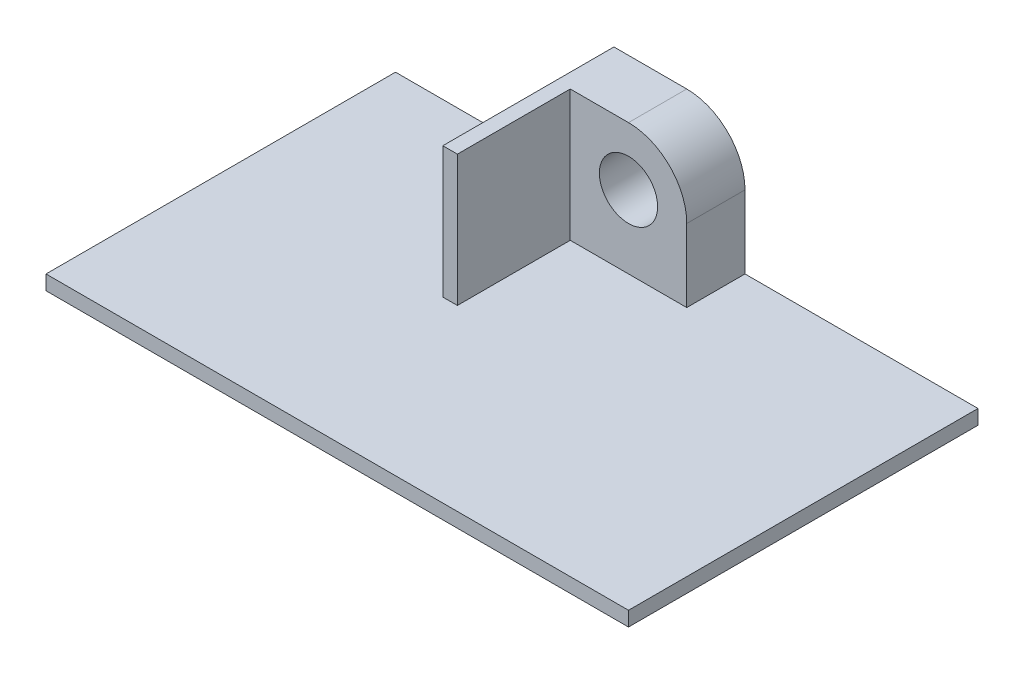
ISO-10303-21;
HEADER;
FILE_DESCRIPTION(('STEP AP214'),'2;1');
FILE_NAME('part.step','',(''),(''),'','','');
FILE_SCHEMA(('AUTOMOTIVE_DESIGN { 1 0 10303 214 1 1 1 1 }'));
ENDSEC;
DATA;
#1=APPLICATION_CONTEXT('core data for automotive mechanical design processes');
#2=APPLICATION_PROTOCOL_DEFINITION('international standard','automotive_design',2000,#1);
#3=PRODUCT_CONTEXT('',#1,'mechanical');
#4=PRODUCT('Part','Part','',(#3));
#5=PRODUCT_RELATED_PRODUCT_CATEGORY('part','',(#4));
#6=PRODUCT_DEFINITION_FORMATION('','',#4);
#7=PRODUCT_DEFINITION_CONTEXT('part definition',#1,'design');
#8=PRODUCT_DEFINITION('design','',#6,#7);
#9=PRODUCT_DEFINITION_SHAPE('','',#8);
#10=(LENGTH_UNIT() NAMED_UNIT(*) SI_UNIT(.MILLI.,.METRE.));
#11=(NAMED_UNIT(*) PLANE_ANGLE_UNIT() SI_UNIT($,.RADIAN.));
#12=(NAMED_UNIT(*) SI_UNIT($,.STERADIAN.) SOLID_ANGLE_UNIT());
#13=UNCERTAINTY_MEASURE_WITH_UNIT(LENGTH_MEASURE(1.E-05),#10,'distance_accuracy_value','');
#14=(GEOMETRIC_REPRESENTATION_CONTEXT(3) GLOBAL_UNCERTAINTY_ASSIGNED_CONTEXT((#13)) GLOBAL_UNIT_ASSIGNED_CONTEXT((#10,
#11,#12)) REPRESENTATION_CONTEXT('',''));
#15=CARTESIAN_POINT('',(0.,0.,0.));
#16=DIRECTION('',(0.,0.,1.));
#17=DIRECTION('',(1.,0.,0.));
#18=AXIS2_PLACEMENT_3D('',#15,#16,#17);
#19=CARTESIAN_POINT('',(0.,1.5875,38.1));
#20=DIRECTION('',(0.,-1.,0.));
#21=DIRECTION('',(0.,0.,-1.));
#22=AXIS2_PLACEMENT_3D('',#19,#20,#21);
#23=PLANE('',#22);
#24=DIRECTION('',(0.,0.,-1.));
#25=VECTOR('',#24,1.);
#26=CARTESIAN_POINT('',(25.4,1.5875,0.));
#27=LINE('',#26,#25);
#28=CARTESIAN_POINT('',(25.4,1.5875,18.653125));
#29=VERTEX_POINT('',#28);
#30=CARTESIAN_POINT('',(25.4,1.5875,6.35));
#31=VERTEX_POINT('',#30);
#32=EDGE_CURVE('E55',#29,#31,#27,.T.);
#33=ORIENTED_EDGE('',*,*,#32,.F.);
#34=DIRECTION('',(1.,0.,0.));
#35=VECTOR('',#34,1.);
#36=CARTESIAN_POINT('',(25.4,1.5875,18.653125));
#37=LINE('',#36,#35);
#38=CARTESIAN_POINT('',(23.8125,1.5875,18.653125));
#39=VERTEX_POINT('',#38);
#40=EDGE_CURVE('E60',#39,#29,#37,.T.);
#41=ORIENTED_EDGE('',*,*,#40,.F.);
#42=DIRECTION('',(0.,0.,1.));
#43=VECTOR('',#42,1.);
#44=CARTESIAN_POINT('',(23.8125,1.5875,0.));
#45=LINE('',#44,#43);
#46=CARTESIAN_POINT('',(23.8125,1.5875,0.));
#47=VERTEX_POINT('',#46);
#48=EDGE_CURVE('E130',#47,#39,#45,.T.);
#49=ORIENTED_EDGE('',*,*,#48,.F.);
#50=DIRECTION('',(-1.,0.,0.));
#51=VECTOR('',#50,1.);
#52=CARTESIAN_POINT('',(0.,1.5875,0.));
#53=LINE('',#52,#51);
#54=CARTESIAN_POINT('',(0.,1.5875,0.));
#55=VERTEX_POINT('',#54);
#56=EDGE_CURVE('E230',#47,#55,#53,.T.);
#57=ORIENTED_EDGE('',*,*,#56,.T.);
#58=DIRECTION('',(0.,0.,-1.));
#59=VECTOR('',#58,1.);
#60=CARTESIAN_POINT('',(0.,1.5875,38.1));
#61=LINE('',#60,#59);
#62=CARTESIAN_POINT('',(0.,1.5875,38.1));
#63=VERTEX_POINT('',#62);
#64=EDGE_CURVE('E220',#63,#55,#61,.T.);
#65=ORIENTED_EDGE('',*,*,#64,.F.);
#66=DIRECTION('',(-1.,0.,0.));
#67=VECTOR('',#66,1.);
#68=CARTESIAN_POINT('',(0.,1.5875,38.1));
#69=LINE('',#68,#67);
#70=CARTESIAN_POINT('',(63.5,1.5875,38.1));
#71=VERTEX_POINT('',#70);
#72=EDGE_CURVE('E217',#71,#63,#69,.T.);
#73=ORIENTED_EDGE('',*,*,#72,.F.);
#74=DIRECTION('',(0.,0.,-1.));
#75=VECTOR('',#74,1.);
#76=CARTESIAN_POINT('',(63.5,1.5875,38.1));
#77=LINE('',#76,#75);
#78=CARTESIAN_POINT('',(63.5,1.5875,0.));
#79=VERTEX_POINT('',#78);
#80=EDGE_CURVE('E237',#71,#79,#77,.T.);
#81=ORIENTED_EDGE('',*,*,#80,.T.);
#82=CARTESIAN_POINT('',(38.1,1.5875,0.));
#83=VERTEX_POINT('',#82);
#84=EDGE_CURVE('E211',#79,#83,#53,.T.);
#85=ORIENTED_EDGE('',*,*,#84,.T.);
#86=DIRECTION('',(0.,0.,-1.));
#87=VECTOR('',#86,1.);
#88=CARTESIAN_POINT('',(38.1,1.5875,6.35));
#89=LINE('',#88,#87);
#90=CARTESIAN_POINT('',(38.1,1.5875,6.35));
#91=VERTEX_POINT('',#90);
#92=EDGE_CURVE('E201',#91,#83,#89,.T.);
#93=ORIENTED_EDGE('',*,*,#92,.F.);
#94=DIRECTION('',(-1.,0.,0.));
#95=VECTOR('',#94,1.);
#96=CARTESIAN_POINT('',(38.1,1.5875,6.35));
#97=LINE('',#96,#95);
#98=EDGE_CURVE('E176',#91,#31,#97,.T.);
#99=ORIENTED_EDGE('',*,*,#98,.T.);
#100=EDGE_LOOP('',(#33,#41,#49,#57,#65,#73,#81,#85,#93,#99));
#101=FACE_BOUND('',#100,.T.);
#102=ADVANCED_FACE('F39',(#101),#23,.F.);
#103=CARTESIAN_POINT('',(0.,0.,38.1));
#104=DIRECTION('',(1.,0.,0.));
#105=DIRECTION('',(0.,0.,-1.));
#106=AXIS2_PLACEMENT_3D('',#103,#104,#105);
#107=PLANE('',#106);
#108=DIRECTION('',(0.,-1.,0.));
#109=VECTOR('',#108,1.);
#110=CARTESIAN_POINT('',(0.,0.,0.));
#111=LINE('',#110,#109);
#112=CARTESIAN_POINT('',(0.,0.,0.));
#113=VERTEX_POINT('',#112);
#114=EDGE_CURVE('E200',#55,#113,#111,.T.);
#115=ORIENTED_EDGE('',*,*,#114,.T.);
#116=DIRECTION('',(0.,0.,-1.));
#117=VECTOR('',#116,1.);
#118=CARTESIAN_POINT('',(0.,0.,38.1));
#119=LINE('',#118,#117);
#120=CARTESIAN_POINT('',(0.,0.,38.1));
#121=VERTEX_POINT('',#120);
#122=EDGE_CURVE('E11',#121,#113,#119,.T.);
#123=ORIENTED_EDGE('',*,*,#122,.F.);
#124=DIRECTION('',(0.,-1.,0.));
#125=VECTOR('',#124,1.);
#126=CARTESIAN_POINT('',(0.,0.,38.1));
#127=LINE('',#126,#125);
#128=EDGE_CURVE('E206',#63,#121,#127,.T.);
#129=ORIENTED_EDGE('',*,*,#128,.F.);
#130=ORIENTED_EDGE('',*,*,#64,.T.);
#131=EDGE_LOOP('',(#115,#123,#129,#130));
#132=FACE_BOUND('',#131,.T.);
#133=ADVANCED_FACE('F41',(#132),#107,.F.);
#134=CARTESIAN_POINT('',(0.,0.,38.1));
#135=DIRECTION('',(0.,1.,0.));
#136=DIRECTION('',(0.,0.,1.));
#137=AXIS2_PLACEMENT_3D('',#134,#135,#136);
#138=PLANE('',#137);
#139=DIRECTION('',(1.,0.,0.));
#140=VECTOR('',#139,1.);
#141=CARTESIAN_POINT('',(0.,0.,0.));
#142=LINE('',#141,#140);
#143=CARTESIAN_POINT('',(63.5,0.,0.));
#144=VERTEX_POINT('',#143);
#145=EDGE_CURVE('E224',#113,#144,#142,.T.);
#146=ORIENTED_EDGE('',*,*,#145,.T.);
#147=DIRECTION('',(0.,0.,-1.));
#148=VECTOR('',#147,1.);
#149=CARTESIAN_POINT('',(63.5,0.,38.1));
#150=LINE('',#149,#148);
#151=CARTESIAN_POINT('',(63.5,0.,38.1));
#152=VERTEX_POINT('',#151);
#153=EDGE_CURVE('E48',#152,#144,#150,.T.);
#154=ORIENTED_EDGE('',*,*,#153,.F.);
#155=DIRECTION('',(1.,0.,0.));
#156=VECTOR('',#155,1.);
#157=CARTESIAN_POINT('',(0.,0.,38.1));
#158=LINE('',#157,#156);
#159=EDGE_CURVE('E210',#121,#152,#158,.T.);
#160=ORIENTED_EDGE('',*,*,#159,.F.);
#161=ORIENTED_EDGE('',*,*,#122,.T.);
#162=EDGE_LOOP('',(#146,#154,#160,#161));
#163=FACE_BOUND('',#162,.T.);
#164=ADVANCED_FACE('F263',(#163),#138,.F.);
#165=CARTESIAN_POINT('',(63.5,0.,38.1));
#166=DIRECTION('',(-1.,0.,0.));
#167=DIRECTION('',(0.,0.,1.));
#168=AXIS2_PLACEMENT_3D('',#165,#166,#167);
#169=PLANE('',#168);
#170=DIRECTION('',(0.,1.,0.));
#171=VECTOR('',#170,1.);
#172=CARTESIAN_POINT('',(63.5,0.,0.));
#173=LINE('',#172,#171);
#174=EDGE_CURVE('E227',#144,#79,#173,.T.);
#175=ORIENTED_EDGE('',*,*,#174,.T.);
#176=ORIENTED_EDGE('',*,*,#80,.F.);
#177=DIRECTION('',(0.,1.,0.));
#178=VECTOR('',#177,1.);
#179=CARTESIAN_POINT('',(63.5,0.,38.1));
#180=LINE('',#179,#178);
#181=EDGE_CURVE('E214',#152,#71,#180,.T.);
#182=ORIENTED_EDGE('',*,*,#181,.F.);
#183=ORIENTED_EDGE('',*,*,#153,.T.);
#184=EDGE_LOOP('',(#175,#176,#182,#183));
#185=FACE_BOUND('',#184,.T.);
#186=ADVANCED_FACE('F246',(#185),#169,.F.);
#187=CARTESIAN_POINT('',(0.,0.,38.1));
#188=DIRECTION('',(0.,0.,-1.));
#189=DIRECTION('',(-1.,0.,0.));
#190=AXIS2_PLACEMENT_3D('',#187,#188,#189);
#191=PLANE('',#190);
#192=ORIENTED_EDGE('',*,*,#128,.T.);
#193=ORIENTED_EDGE('',*,*,#159,.T.);
#194=ORIENTED_EDGE('',*,*,#181,.T.);
#195=ORIENTED_EDGE('',*,*,#72,.T.);
#196=EDGE_LOOP('',(#192,#193,#194,#195));
#197=FACE_BOUND('',#196,.T.);
#198=ADVANCED_FACE('F261',(#197),#191,.F.);
#199=CARTESIAN_POINT('',(0.,0.,0.));
#200=DIRECTION('',(0.,0.,-1.));
#201=DIRECTION('',(-1.,0.,0.));
#202=AXIS2_PLACEMENT_3D('',#199,#200,#201);
#203=PLANE('',#202);
#204=ORIENTED_EDGE('',*,*,#56,.F.);
#205=DIRECTION('',(0.,-1.,0.));
#206=VECTOR('',#205,1.);
#207=CARTESIAN_POINT('',(23.8125,34.5955563089248,0.));
#208=LINE('',#207,#206);
#209=CARTESIAN_POINT('',(23.8125,15.875,0.));
#210=VERTEX_POINT('',#209);
#211=EDGE_CURVE('E159',#210,#47,#208,.T.);
#212=ORIENTED_EDGE('',*,*,#211,.F.);
#213=DIRECTION('',(1.,0.,0.));
#214=VECTOR('',#213,1.);
#215=CARTESIAN_POINT('',(31.75,15.875,0.));
#216=LINE('',#215,#214);
#217=CARTESIAN_POINT('',(31.75,15.875,0.));
#218=VERTEX_POINT('',#217);
#219=EDGE_CURVE('E146',#210,#218,#216,.T.);
#220=ORIENTED_EDGE('',*,*,#219,.T.);
#221=CARTESIAN_POINT('',(31.75,9.525,0.));
#222=DIRECTION('',(0.,0.,-1.));
#223=DIRECTION('',(-1.,0.,0.));
#224=AXIS2_PLACEMENT_3D('',#221,#222,#223);
#225=CIRCLE('',#224,6.35);
#226=CARTESIAN_POINT('',(38.1,9.525,0.));
#227=VERTEX_POINT('',#226);
#228=EDGE_CURVE('E166',#218,#227,#225,.T.);
#229=ORIENTED_EDGE('',*,*,#228,.T.);
#230=DIRECTION('',(0.,-1.,0.));
#231=VECTOR('',#230,1.);
#232=CARTESIAN_POINT('',(38.1,9.525,0.));
#233=LINE('',#232,#231);
#234=EDGE_CURVE('E191',#227,#83,#233,.T.);
#235=ORIENTED_EDGE('',*,*,#234,.T.);
#236=ORIENTED_EDGE('',*,*,#84,.F.);
#237=ORIENTED_EDGE('',*,*,#174,.F.);
#238=ORIENTED_EDGE('',*,*,#145,.F.);
#239=ORIENTED_EDGE('',*,*,#114,.F.);
#240=EDGE_LOOP('',(#204,#212,#220,#229,#235,#236,#237,#238,#239));
#241=FACE_BOUND('',#240,.T.);
#242=CARTESIAN_POINT('',(31.75,9.525,0.));
#243=DIRECTION('',(0.,0.,-1.));
#244=DIRECTION('',(-1.,0.,0.));
#245=AXIS2_PLACEMENT_3D('',#242,#243,#244);
#246=CIRCLE('',#245,3.175);
#247=CARTESIAN_POINT('',(28.575,9.525,0.));
#248=VERTEX_POINT('',#247);
#249=EDGE_CURVE('E148',#248,#248,#246,.T.);
#250=ORIENTED_EDGE('',*,*,#249,.F.);
#251=EDGE_LOOP('',(#250));
#252=FACE_BOUND('',#251,.T.);
#253=ADVANCED_FACE('F252',(#241,#252),#203,.T.);
#254=CARTESIAN_POINT('',(31.75,9.525,6.35));
#255=DIRECTION('',(0.,0.,-1.));
#256=DIRECTION('',(-1.,0.,0.));
#257=AXIS2_PLACEMENT_3D('',#254,#255,#256);
#258=CYLINDRICAL_SURFACE('',#257,6.35);
#259=ORIENTED_EDGE('',*,*,#228,.F.);
#260=DIRECTION('',(0.,0.,-1.));
#261=VECTOR('',#260,1.);
#262=CARTESIAN_POINT('',(31.75,15.875,6.35));
#263=LINE('',#262,#261);
#264=CARTESIAN_POINT('',(31.75,15.875,6.35));
#265=VERTEX_POINT('',#264);
#266=EDGE_CURVE('E197',#265,#218,#263,.T.);
#267=ORIENTED_EDGE('',*,*,#266,.F.);
#268=CARTESIAN_POINT('',(31.75,9.525,6.35));
#269=DIRECTION('',(0.,0.,-1.));
#270=DIRECTION('',(-1.,0.,0.));
#271=AXIS2_PLACEMENT_3D('',#268,#269,#270);
#272=CIRCLE('',#271,6.35);
#273=CARTESIAN_POINT('',(38.1,9.525,6.35));
#274=VERTEX_POINT('',#273);
#275=EDGE_CURVE('E168',#265,#274,#272,.T.);
#276=ORIENTED_EDGE('',*,*,#275,.T.);
#277=DIRECTION('',(0.,0.,-1.));
#278=VECTOR('',#277,1.);
#279=CARTESIAN_POINT('',(38.1,9.525,6.35));
#280=LINE('',#279,#278);
#281=EDGE_CURVE('E187',#274,#227,#280,.T.);
#282=ORIENTED_EDGE('',*,*,#281,.T.);
#283=EDGE_LOOP('',(#259,#267,#276,#282));
#284=FACE_BOUND('',#283,.T.);
#285=ADVANCED_FACE('F278',(#284),#258,.T.);
#286=CARTESIAN_POINT('',(31.75,15.875,6.35));
#287=DIRECTION('',(0.,1.,0.));
#288=DIRECTION('',(0.,0.,1.));
#289=AXIS2_PLACEMENT_3D('',#286,#287,#288);
#290=PLANE('',#289);
#291=ORIENTED_EDGE('',*,*,#219,.F.);
#292=DIRECTION('',(0.,0.,1.));
#293=VECTOR('',#292,1.);
#294=CARTESIAN_POINT('',(23.8125,15.875,0.));
#295=LINE('',#294,#293);
#296=CARTESIAN_POINT('',(23.8125,15.875,18.653125));
#297=VERTEX_POINT('',#296);
#298=EDGE_CURVE('E128',#210,#297,#295,.T.);
#299=ORIENTED_EDGE('',*,*,#298,.T.);
#300=DIRECTION('',(1.,0.,0.));
#301=VECTOR('',#300,1.);
#302=CARTESIAN_POINT('',(25.4,15.875,18.653125));
#303=LINE('',#302,#301);
#304=CARTESIAN_POINT('',(25.4,15.875,18.653125));
#305=VERTEX_POINT('',#304);
#306=EDGE_CURVE('E135',#297,#305,#303,.T.);
#307=ORIENTED_EDGE('',*,*,#306,.T.);
#308=DIRECTION('',(0.,0.,-1.));
#309=VECTOR('',#308,1.);
#310=CARTESIAN_POINT('',(25.4,15.875,0.));
#311=LINE('',#310,#309);
#312=CARTESIAN_POINT('',(25.4,15.875,6.35));
#313=VERTEX_POINT('',#312);
#314=EDGE_CURVE('E142',#305,#313,#311,.T.);
#315=ORIENTED_EDGE('',*,*,#314,.T.);
#316=DIRECTION('',(1.,0.,0.));
#317=VECTOR('',#316,1.);
#318=CARTESIAN_POINT('',(31.75,15.875,6.35));
#319=LINE('',#318,#317);
#320=EDGE_CURVE('E183',#313,#265,#319,.T.);
#321=ORIENTED_EDGE('',*,*,#320,.T.);
#322=ORIENTED_EDGE('',*,*,#266,.T.);
#323=EDGE_LOOP('',(#291,#299,#307,#315,#321,#322));
#324=FACE_BOUND('',#323,.T.);
#325=ADVANCED_FACE('F144',(#324),#290,.T.);
#326=CARTESIAN_POINT('',(38.1,9.525,6.35));
#327=DIRECTION('',(1.,0.,0.));
#328=DIRECTION('',(0.,0.,-1.));
#329=AXIS2_PLACEMENT_3D('',#326,#327,#328);
#330=PLANE('',#329);
#331=ORIENTED_EDGE('',*,*,#234,.F.);
#332=ORIENTED_EDGE('',*,*,#281,.F.);
#333=DIRECTION('',(0.,-1.,0.));
#334=VECTOR('',#333,1.);
#335=CARTESIAN_POINT('',(38.1,9.525,6.35));
#336=LINE('',#335,#334);
#337=EDGE_CURVE('E172',#274,#91,#336,.T.);
#338=ORIENTED_EDGE('',*,*,#337,.T.);
#339=ORIENTED_EDGE('',*,*,#92,.T.);
#340=EDGE_LOOP('',(#331,#332,#338,#339));
#341=FACE_BOUND('',#340,.T.);
#342=ADVANCED_FACE('F280',(#341),#330,.T.);
#343=CARTESIAN_POINT('',(31.75,9.525,6.35));
#344=DIRECTION('',(0.,0.,-1.));
#345=DIRECTION('',(-1.,0.,0.));
#346=AXIS2_PLACEMENT_3D('',#343,#344,#345);
#347=PLANE('',#346);
#348=CARTESIAN_POINT('',(31.75,9.525,6.35));
#349=DIRECTION('',(0.,0.,-1.));
#350=DIRECTION('',(-1.,0.,0.));
#351=AXIS2_PLACEMENT_3D('',#348,#349,#350);
#352=CIRCLE('',#351,3.175);
#353=CARTESIAN_POINT('',(28.575,9.525,6.35));
#354=VERTEX_POINT('',#353);
#355=EDGE_CURVE('E153',#354,#354,#352,.T.);
#356=ORIENTED_EDGE('',*,*,#355,.T.);
#357=EDGE_LOOP('',(#356));
#358=FACE_BOUND('',#357,.T.);
#359=ORIENTED_EDGE('',*,*,#275,.F.);
#360=ORIENTED_EDGE('',*,*,#320,.F.);
#361=DIRECTION('',(0.,1.,0.));
#362=VECTOR('',#361,1.);
#363=CARTESIAN_POINT('',(25.4,1.5875,6.35));
#364=LINE('',#363,#362);
#365=EDGE_CURVE('E179',#31,#313,#364,.T.);
#366=ORIENTED_EDGE('',*,*,#365,.F.);
#367=ORIENTED_EDGE('',*,*,#98,.F.);
#368=ORIENTED_EDGE('',*,*,#337,.F.);
#369=EDGE_LOOP('',(#359,#360,#366,#367,#368));
#370=FACE_BOUND('',#369,.T.);
#371=ADVANCED_FACE('F275',(#358,#370),#347,.F.);
#372=CARTESIAN_POINT('',(31.75,9.525,6.35));
#373=DIRECTION('',(0.,0.,-1.));
#374=DIRECTION('',(-1.,0.,0.));
#375=AXIS2_PLACEMENT_3D('',#372,#373,#374);
#376=CYLINDRICAL_SURFACE('',#375,3.175);
#377=ORIENTED_EDGE('',*,*,#355,.F.);
#378=EDGE_LOOP('',(#377));
#379=FACE_BOUND('',#378,.T.);
#380=ORIENTED_EDGE('',*,*,#249,.T.);
#381=EDGE_LOOP('',(#380));
#382=FACE_BOUND('',#381,.T.);
#383=ADVANCED_FACE('F287',(#379,#382),#376,.F.);
#384=CARTESIAN_POINT('',(25.4,34.5955563089248,0.));
#385=DIRECTION('',(-1.,0.,0.));
#386=DIRECTION('',(0.,0.,1.));
#387=AXIS2_PLACEMENT_3D('',#384,#385,#386);
#388=PLANE('',#387);
#389=ORIENTED_EDGE('',*,*,#32,.T.);
#390=ORIENTED_EDGE('',*,*,#365,.T.);
#391=ORIENTED_EDGE('',*,*,#314,.F.);
#392=DIRECTION('',(0.,-1.,0.));
#393=VECTOR('',#392,1.);
#394=CARTESIAN_POINT('',(25.4,34.5955563089248,18.653125));
#395=LINE('',#394,#393);
#396=EDGE_CURVE('E137',#305,#29,#395,.T.);
#397=ORIENTED_EDGE('',*,*,#396,.T.);
#398=EDGE_LOOP('',(#389,#390,#391,#397));
#399=FACE_BOUND('',#398,.T.);
#400=ADVANCED_FACE('F271',(#399),#388,.F.);
#401=CARTESIAN_POINT('',(23.8125,34.5955563089248,0.));
#402=DIRECTION('',(1.,0.,0.));
#403=DIRECTION('',(0.,0.,-1.));
#404=AXIS2_PLACEMENT_3D('',#401,#402,#403);
#405=PLANE('',#404);
#406=ORIENTED_EDGE('',*,*,#298,.F.);
#407=ORIENTED_EDGE('',*,*,#211,.T.);
#408=ORIENTED_EDGE('',*,*,#48,.T.);
#409=DIRECTION('',(0.,-1.,0.));
#410=VECTOR('',#409,1.);
#411=CARTESIAN_POINT('',(23.8125,34.5955563089248,18.653125));
#412=LINE('',#411,#410);
#413=EDGE_CURVE('E123',#297,#39,#412,.T.);
#414=ORIENTED_EDGE('',*,*,#413,.F.);
#415=EDGE_LOOP('',(#406,#407,#408,#414));
#416=FACE_BOUND('',#415,.T.);
#417=ADVANCED_FACE('F125',(#416),#405,.F.);
#418=CARTESIAN_POINT('',(25.4,34.5955563089248,18.653125));
#419=DIRECTION('',(0.,0.,-1.));
#420=DIRECTION('',(-1.,0.,0.));
#421=AXIS2_PLACEMENT_3D('',#418,#419,#420);
#422=PLANE('',#421);
#423=ORIENTED_EDGE('',*,*,#306,.F.);
#424=ORIENTED_EDGE('',*,*,#413,.T.);
#425=ORIENTED_EDGE('',*,*,#40,.T.);
#426=ORIENTED_EDGE('',*,*,#396,.F.);
#427=EDGE_LOOP('',(#423,#424,#425,#426));
#428=FACE_BOUND('',#427,.T.);
#429=ADVANCED_FACE('F136',(#428),#422,.F.);
#430=CLOSED_SHELL('',(#102,#133,#164,#186,#198,#253,#285,#325,#342,#371,#383,#400,#417,#429));
#431=MANIFOLD_SOLID_BREP('B2',#430);
#432=ADVANCED_BREP_SHAPE_REPRESENTATION('',(#18,#431),#14);
#433=SHAPE_DEFINITION_REPRESENTATION(#9,#432);
ENDSEC;
END-ISO-10303-21;
